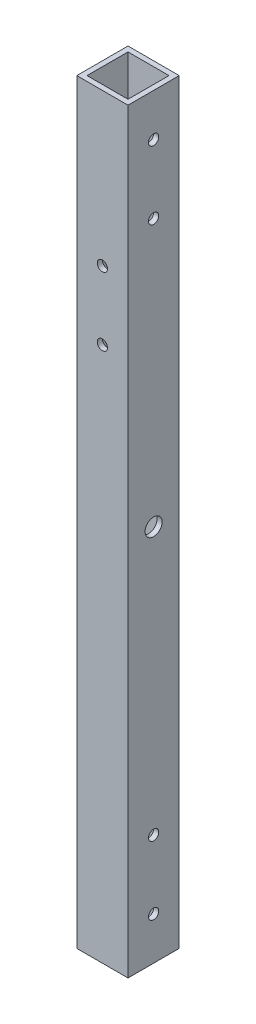
ISO-10303-21;
HEADER;
FILE_DESCRIPTION(('STEP AP214'),'2;1');
FILE_NAME('part.step','',(''),(''),'','','');
FILE_SCHEMA(('AUTOMOTIVE_DESIGN { 1 0 10303 214 1 1 1 1 }'));
ENDSEC;
DATA;
#1=APPLICATION_CONTEXT('core data for automotive mechanical design processes');
#2=APPLICATION_PROTOCOL_DEFINITION('international standard','automotive_design',2000,#1);
#3=PRODUCT_CONTEXT('',#1,'mechanical');
#4=PRODUCT('Part','Part','',(#3));
#5=PRODUCT_RELATED_PRODUCT_CATEGORY('part','',(#4));
#6=PRODUCT_DEFINITION_FORMATION('','',#4);
#7=PRODUCT_DEFINITION_CONTEXT('part definition',#1,'design');
#8=PRODUCT_DEFINITION('design','',#6,#7);
#9=PRODUCT_DEFINITION_SHAPE('','',#8);
#10=(LENGTH_UNIT() NAMED_UNIT(*) SI_UNIT(.MILLI.,.METRE.));
#11=(NAMED_UNIT(*) PLANE_ANGLE_UNIT() SI_UNIT($,.RADIAN.));
#12=(NAMED_UNIT(*) SI_UNIT($,.STERADIAN.) SOLID_ANGLE_UNIT());
#13=UNCERTAINTY_MEASURE_WITH_UNIT(LENGTH_MEASURE(1.E-05),#10,'distance_accuracy_value','');
#14=(GEOMETRIC_REPRESENTATION_CONTEXT(3) GLOBAL_UNCERTAINTY_ASSIGNED_CONTEXT((#13)) GLOBAL_UNIT_ASSIGNED_CONTEXT((#10,
#11,#12)) REPRESENTATION_CONTEXT('',''));
#15=CARTESIAN_POINT('',(0.,0.,0.));
#16=DIRECTION('',(0.,0.,1.));
#17=DIRECTION('',(1.,0.,0.));
#18=AXIS2_PLACEMENT_3D('',#15,#16,#17);
#19=CARTESIAN_POINT('',(0.,221.3,0.));
#20=DIRECTION('',(0.,1.,0.));
#21=DIRECTION('',(0.,0.,1.));
#22=AXIS2_PLACEMENT_3D('',#19,#20,#21);
#23=PLANE('',#22);
#24=DIRECTION('',(0.,0.,1.));
#25=VECTOR('',#24,1.);
#26=CARTESIAN_POINT('',(0.,221.3,0.));
#27=LINE('',#26,#25);
#28=CARTESIAN_POINT('',(0.,221.3,-15.));
#29=VERTEX_POINT('',#28);
#30=CARTESIAN_POINT('',(0.,221.3,0.));
#31=VERTEX_POINT('',#30);
#32=EDGE_CURVE('E170',#29,#31,#27,.T.);
#33=ORIENTED_EDGE('',*,*,#32,.T.);
#34=DIRECTION('',(1.,0.,0.));
#35=VECTOR('',#34,1.);
#36=CARTESIAN_POINT('',(0.,221.3,0.));
#37=LINE('',#36,#35);
#38=CARTESIAN_POINT('',(15.,221.3,0.));
#39=VERTEX_POINT('',#38);
#40=EDGE_CURVE('E173',#31,#39,#37,.T.);
#41=ORIENTED_EDGE('',*,*,#40,.T.);
#42=DIRECTION('',(0.,0.,-1.));
#43=VECTOR('',#42,1.);
#44=CARTESIAN_POINT('',(15.,221.3,0.));
#45=LINE('',#44,#43);
#46=CARTESIAN_POINT('',(15.,221.3,-15.));
#47=VERTEX_POINT('',#46);
#48=EDGE_CURVE('E176',#39,#47,#45,.T.);
#49=ORIENTED_EDGE('',*,*,#48,.T.);
#50=DIRECTION('',(-1.,0.,0.));
#51=VECTOR('',#50,1.);
#52=CARTESIAN_POINT('',(0.,221.3,-15.));
#53=LINE('',#52,#51);
#54=EDGE_CURVE('E178',#47,#29,#53,.T.);
#55=ORIENTED_EDGE('',*,*,#54,.T.);
#56=EDGE_LOOP('',(#33,#41,#49,#55));
#57=FACE_BOUND('',#56,.T.);
#58=DIRECTION('',(1.,0.,0.));
#59=VECTOR('',#58,1.);
#60=CARTESIAN_POINT('',(0.,221.3,-1.5));
#61=LINE('',#60,#59);
#62=CARTESIAN_POINT('',(1.5,221.3,-1.5));
#63=VERTEX_POINT('',#62);
#64=CARTESIAN_POINT('',(13.5,221.3,-1.5));
#65=VERTEX_POINT('',#64);
#66=EDGE_CURVE('E140',#63,#65,#61,.T.);
#67=ORIENTED_EDGE('',*,*,#66,.F.);
#68=DIRECTION('',(0.,0.,1.));
#69=VECTOR('',#68,1.);
#70=CARTESIAN_POINT('',(1.5,221.3,0.));
#71=LINE('',#70,#69);
#72=CARTESIAN_POINT('',(1.5,221.3,-13.5));
#73=VERTEX_POINT('',#72);
#74=EDGE_CURVE('E132',#73,#63,#71,.T.);
#75=ORIENTED_EDGE('',*,*,#74,.F.);
#76=DIRECTION('',(-1.,0.,0.));
#77=VECTOR('',#76,1.);
#78=CARTESIAN_POINT('',(0.,221.3,-13.5));
#79=LINE('',#78,#77);
#80=CARTESIAN_POINT('',(13.5,221.3,-13.5));
#81=VERTEX_POINT('',#80);
#82=EDGE_CURVE('E154',#81,#73,#79,.T.);
#83=ORIENTED_EDGE('',*,*,#82,.F.);
#84=DIRECTION('',(0.,0.,-1.));
#85=VECTOR('',#84,1.);
#86=CARTESIAN_POINT('',(13.5,221.3,0.));
#87=LINE('',#86,#85);
#88=EDGE_CURVE('E152',#65,#81,#87,.T.);
#89=ORIENTED_EDGE('',*,*,#88,.F.);
#90=EDGE_LOOP('',(#67,#75,#83,#89));
#91=FACE_BOUND('',#90,.T.);
#92=ADVANCED_FACE('F65',(#57,#91),#23,.T.);
#93=CARTESIAN_POINT('',(0.,0.,0.));
#94=DIRECTION('',(0.,1.,0.));
#95=DIRECTION('',(0.,0.,1.));
#96=AXIS2_PLACEMENT_3D('',#93,#94,#95);
#97=PLANE('',#96);
#98=DIRECTION('',(0.,0.,1.));
#99=VECTOR('',#98,1.);
#100=CARTESIAN_POINT('',(0.,0.,0.));
#101=LINE('',#100,#99);
#102=CARTESIAN_POINT('',(0.,0.,-15.));
#103=VERTEX_POINT('',#102);
#104=CARTESIAN_POINT('',(0.,0.,0.));
#105=VERTEX_POINT('',#104);
#106=EDGE_CURVE('E148',#103,#105,#101,.T.);
#107=ORIENTED_EDGE('',*,*,#106,.F.);
#108=DIRECTION('',(-1.,0.,0.));
#109=VECTOR('',#108,1.);
#110=CARTESIAN_POINT('',(0.,0.,-15.));
#111=LINE('',#110,#109);
#112=CARTESIAN_POINT('',(15.,0.,-15.));
#113=VERTEX_POINT('',#112);
#114=EDGE_CURVE('E174',#113,#103,#111,.T.);
#115=ORIENTED_EDGE('',*,*,#114,.F.);
#116=DIRECTION('',(0.,0.,-1.));
#117=VECTOR('',#116,1.);
#118=CARTESIAN_POINT('',(15.,0.,0.));
#119=LINE('',#118,#117);
#120=CARTESIAN_POINT('',(15.,0.,0.));
#121=VERTEX_POINT('',#120);
#122=EDGE_CURVE('E185',#121,#113,#119,.T.);
#123=ORIENTED_EDGE('',*,*,#122,.F.);
#124=DIRECTION('',(1.,0.,0.));
#125=VECTOR('',#124,1.);
#126=CARTESIAN_POINT('',(0.,0.,0.));
#127=LINE('',#126,#125);
#128=EDGE_CURVE('E183',#105,#121,#127,.T.);
#129=ORIENTED_EDGE('',*,*,#128,.F.);
#130=EDGE_LOOP('',(#107,#115,#123,#129));
#131=FACE_BOUND('',#130,.T.);
#132=DIRECTION('',(0.,0.,1.));
#133=VECTOR('',#132,1.);
#134=CARTESIAN_POINT('',(1.5,0.,0.));
#135=LINE('',#134,#133);
#136=CARTESIAN_POINT('',(1.5,0.,-13.5));
#137=VERTEX_POINT('',#136);
#138=CARTESIAN_POINT('',(1.5,0.,-1.5));
#139=VERTEX_POINT('',#138);
#140=EDGE_CURVE('E90',#137,#139,#135,.T.);
#141=ORIENTED_EDGE('',*,*,#140,.T.);
#142=DIRECTION('',(1.,0.,0.));
#143=VECTOR('',#142,1.);
#144=CARTESIAN_POINT('',(0.,0.,-1.5));
#145=LINE('',#144,#143);
#146=CARTESIAN_POINT('',(13.5,0.,-1.5));
#147=VERTEX_POINT('',#146);
#148=EDGE_CURVE('E147',#139,#147,#145,.T.);
#149=ORIENTED_EDGE('',*,*,#148,.T.);
#150=DIRECTION('',(0.,0.,-1.));
#151=VECTOR('',#150,1.);
#152=CARTESIAN_POINT('',(13.5,0.,0.));
#153=LINE('',#152,#151);
#154=CARTESIAN_POINT('',(13.5,0.,-13.5));
#155=VERTEX_POINT('',#154);
#156=EDGE_CURVE('E162',#147,#155,#153,.T.);
#157=ORIENTED_EDGE('',*,*,#156,.T.);
#158=DIRECTION('',(-1.,0.,0.));
#159=VECTOR('',#158,1.);
#160=CARTESIAN_POINT('',(0.,0.,-13.5));
#161=LINE('',#160,#159);
#162=EDGE_CURVE('E141',#155,#137,#161,.T.);
#163=ORIENTED_EDGE('',*,*,#162,.T.);
#164=EDGE_LOOP('',(#141,#149,#157,#163));
#165=FACE_BOUND('',#164,.T.);
#166=ADVANCED_FACE('F304',(#131,#165),#97,.F.);
#167=CARTESIAN_POINT('',(0.,221.3,0.));
#168=DIRECTION('',(1.,0.,0.));
#169=DIRECTION('',(0.,0.,-1.));
#170=AXIS2_PLACEMENT_3D('',#167,#168,#169);
#171=PLANE('',#170);
#172=CARTESIAN_POINT('',(0.,110.65,-7.5));
#173=DIRECTION('',(1.,0.,0.));
#174=DIRECTION('',(0.,0.,-1.));
#175=AXIS2_PLACEMENT_3D('',#172,#173,#174);
#176=CIRCLE('',#175,2.5);
#177=CARTESIAN_POINT('',(0.,110.65,-10.));
#178=VERTEX_POINT('',#177);
#179=EDGE_CURVE('E214',#178,#178,#176,.T.);
#180=ORIENTED_EDGE('',*,*,#179,.T.);
#181=EDGE_LOOP('',(#180));
#182=FACE_BOUND('',#181,.T.);
#183=CARTESIAN_POINT('',(0.,208.8,-7.49999999999862));
#184=DIRECTION('',(-1.,0.,0.));
#185=DIRECTION('',(0.,0.,1.));
#186=AXIS2_PLACEMENT_3D('',#183,#184,#185);
#187=CIRCLE('',#186,1.5);
#188=CARTESIAN_POINT('',(0.,208.8,-5.99999999999862));
#189=VERTEX_POINT('',#188);
#190=EDGE_CURVE('E250',#189,#189,#187,.T.);
#191=ORIENTED_EDGE('',*,*,#190,.F.);
#192=EDGE_LOOP('',(#191));
#193=FACE_BOUND('',#192,.T.);
#194=CARTESIAN_POINT('',(0.,188.8,-7.49999999999862));
#195=DIRECTION('',(-1.,0.,0.));
#196=DIRECTION('',(0.,0.,1.));
#197=AXIS2_PLACEMENT_3D('',#194,#195,#196);
#198=CIRCLE('',#197,1.5);
#199=CARTESIAN_POINT('',(0.,188.8,-5.99999999999862));
#200=VERTEX_POINT('',#199);
#201=EDGE_CURVE('E253',#200,#200,#198,.T.);
#202=ORIENTED_EDGE('',*,*,#201,.F.);
#203=EDGE_LOOP('',(#202));
#204=FACE_BOUND('',#203,.T.);
#205=CARTESIAN_POINT('',(0.,32.5039999999969,-7.49999999999862));
#206=DIRECTION('',(-1.,0.,0.));
#207=DIRECTION('',(0.,0.,1.));
#208=AXIS2_PLACEMENT_3D('',#205,#206,#207);
#209=CIRCLE('',#208,1.5);
#210=CARTESIAN_POINT('',(0.,32.5039999999969,-5.99999999999862));
#211=VERTEX_POINT('',#210);
#212=EDGE_CURVE('E259',#211,#211,#209,.T.);
#213=ORIENTED_EDGE('',*,*,#212,.F.);
#214=EDGE_LOOP('',(#213));
#215=FACE_BOUND('',#214,.T.);
#216=CARTESIAN_POINT('',(0.,12.5039999999969,-7.49999999999862));
#217=DIRECTION('',(-1.,0.,0.));
#218=DIRECTION('',(0.,0.,1.));
#219=AXIS2_PLACEMENT_3D('',#216,#217,#218);
#220=CIRCLE('',#219,1.5);
#221=CARTESIAN_POINT('',(0.,12.5039999999969,-5.99999999999862));
#222=VERTEX_POINT('',#221);
#223=EDGE_CURVE('E265',#222,#222,#220,.T.);
#224=ORIENTED_EDGE('',*,*,#223,.F.);
#225=EDGE_LOOP('',(#224));
#226=FACE_BOUND('',#225,.T.);
#227=ORIENTED_EDGE('',*,*,#106,.T.);
#228=DIRECTION('',(0.,-1.,0.));
#229=VECTOR('',#228,1.);
#230=CARTESIAN_POINT('',(0.,221.3,0.));
#231=LINE('',#230,#229);
#232=EDGE_CURVE('E12',#31,#105,#231,.T.);
#233=ORIENTED_EDGE('',*,*,#232,.F.);
#234=ORIENTED_EDGE('',*,*,#32,.F.);
#235=DIRECTION('',(0.,-1.,0.));
#236=VECTOR('',#235,1.);
#237=CARTESIAN_POINT('',(0.,221.3,-15.));
#238=LINE('',#237,#236);
#239=EDGE_CURVE('E180',#29,#103,#238,.T.);
#240=ORIENTED_EDGE('',*,*,#239,.T.);
#241=EDGE_LOOP('',(#227,#233,#234,#240));
#242=FACE_BOUND('',#241,.T.);
#243=ADVANCED_FACE('F67',(#182,#193,#204,#215,#226,#242),#171,.F.);
#244=CARTESIAN_POINT('',(0.,221.3,0.));
#245=DIRECTION('',(0.,0.,-1.));
#246=DIRECTION('',(-1.,0.,0.));
#247=AXIS2_PLACEMENT_3D('',#244,#245,#246);
#248=PLANE('',#247);
#249=CARTESIAN_POINT('',(7.50000000000002,156.8,0.));
#250=DIRECTION('',(0.,0.,1.));
#251=DIRECTION('',(1.,0.,0.));
#252=AXIS2_PLACEMENT_3D('',#249,#250,#251);
#253=CIRCLE('',#252,1.5);
#254=CARTESIAN_POINT('',(9.00000000000001,156.8,0.));
#255=VERTEX_POINT('',#254);
#256=EDGE_CURVE('E224',#255,#255,#253,.T.);
#257=ORIENTED_EDGE('',*,*,#256,.F.);
#258=EDGE_LOOP('',(#257));
#259=FACE_BOUND('',#258,.T.);
#260=CARTESIAN_POINT('',(7.50000000000002,176.8,0.));
#261=DIRECTION('',(0.,0.,1.));
#262=DIRECTION('',(1.,0.,0.));
#263=AXIS2_PLACEMENT_3D('',#260,#261,#262);
#264=CIRCLE('',#263,1.5);
#265=CARTESIAN_POINT('',(9.00000000000002,176.8,0.));
#266=VERTEX_POINT('',#265);
#267=EDGE_CURVE('E229',#266,#266,#264,.T.);
#268=ORIENTED_EDGE('',*,*,#267,.F.);
#269=EDGE_LOOP('',(#268));
#270=FACE_BOUND('',#269,.T.);
#271=ORIENTED_EDGE('',*,*,#128,.T.);
#272=DIRECTION('',(0.,-1.,0.));
#273=VECTOR('',#272,1.);
#274=CARTESIAN_POINT('',(15.,221.3,0.));
#275=LINE('',#274,#273);
#276=EDGE_CURVE('E74',#39,#121,#275,.T.);
#277=ORIENTED_EDGE('',*,*,#276,.F.);
#278=ORIENTED_EDGE('',*,*,#40,.F.);
#279=ORIENTED_EDGE('',*,*,#232,.T.);
#280=EDGE_LOOP('',(#271,#277,#278,#279));
#281=FACE_BOUND('',#280,.T.);
#282=ADVANCED_FACE('F303',(#259,#270,#281),#248,.F.);
#283=CARTESIAN_POINT('',(15.,221.3,0.));
#284=DIRECTION('',(-1.,0.,0.));
#285=DIRECTION('',(0.,0.,1.));
#286=AXIS2_PLACEMENT_3D('',#283,#284,#285);
#287=PLANE('',#286);
#288=CARTESIAN_POINT('',(15.,110.65,-7.5));
#289=DIRECTION('',(1.,0.,0.));
#290=DIRECTION('',(0.,0.,-1.));
#291=AXIS2_PLACEMENT_3D('',#288,#289,#290);
#292=CIRCLE('',#291,2.5);
#293=CARTESIAN_POINT('',(15.,110.65,-10.));
#294=VERTEX_POINT('',#293);
#295=EDGE_CURVE('E240',#294,#294,#292,.T.);
#296=ORIENTED_EDGE('',*,*,#295,.F.);
#297=EDGE_LOOP('',(#296));
#298=FACE_BOUND('',#297,.T.);
#299=CARTESIAN_POINT('',(15.,208.8,-7.49999999999862));
#300=DIRECTION('',(-1.,0.,0.));
#301=DIRECTION('',(0.,0.,1.));
#302=AXIS2_PLACEMENT_3D('',#299,#300,#301);
#303=CIRCLE('',#302,1.5);
#304=CARTESIAN_POINT('',(15.,208.8,-5.99999999999862));
#305=VERTEX_POINT('',#304);
#306=EDGE_CURVE('E199',#305,#305,#303,.T.);
#307=ORIENTED_EDGE('',*,*,#306,.T.);
#308=EDGE_LOOP('',(#307));
#309=FACE_BOUND('',#308,.T.);
#310=CARTESIAN_POINT('',(15.,188.8,-7.49999999999862));
#311=DIRECTION('',(-1.,0.,0.));
#312=DIRECTION('',(0.,0.,1.));
#313=AXIS2_PLACEMENT_3D('',#310,#311,#312);
#314=CIRCLE('',#313,1.5);
#315=CARTESIAN_POINT('',(15.,188.8,-5.99999999999862));
#316=VERTEX_POINT('',#315);
#317=EDGE_CURVE('E256',#316,#316,#314,.T.);
#318=ORIENTED_EDGE('',*,*,#317,.T.);
#319=EDGE_LOOP('',(#318));
#320=FACE_BOUND('',#319,.T.);
#321=CARTESIAN_POINT('',(15.,32.5039999999969,-7.49999999999862));
#322=DIRECTION('',(-1.,0.,0.));
#323=DIRECTION('',(0.,0.,1.));
#324=AXIS2_PLACEMENT_3D('',#321,#322,#323);
#325=CIRCLE('',#324,1.5);
#326=CARTESIAN_POINT('',(15.,32.5039999999969,-5.99999999999862));
#327=VERTEX_POINT('',#326);
#328=EDGE_CURVE('E262',#327,#327,#325,.T.);
#329=ORIENTED_EDGE('',*,*,#328,.T.);
#330=EDGE_LOOP('',(#329));
#331=FACE_BOUND('',#330,.T.);
#332=CARTESIAN_POINT('',(15.,12.5039999999969,-7.49999999999862));
#333=DIRECTION('',(-1.,0.,0.));
#334=DIRECTION('',(0.,0.,1.));
#335=AXIS2_PLACEMENT_3D('',#332,#333,#334);
#336=CIRCLE('',#335,1.5);
#337=CARTESIAN_POINT('',(15.,12.5039999999969,-5.99999999999862));
#338=VERTEX_POINT('',#337);
#339=EDGE_CURVE('E247',#338,#338,#336,.T.);
#340=ORIENTED_EDGE('',*,*,#339,.T.);
#341=EDGE_LOOP('',(#340));
#342=FACE_BOUND('',#341,.T.);
#343=ORIENTED_EDGE('',*,*,#122,.T.);
#344=DIRECTION('',(0.,-1.,0.));
#345=VECTOR('',#344,1.);
#346=CARTESIAN_POINT('',(15.,221.3,-15.));
#347=LINE('',#346,#345);
#348=EDGE_CURVE('E190',#47,#113,#347,.T.);
#349=ORIENTED_EDGE('',*,*,#348,.F.);
#350=ORIENTED_EDGE('',*,*,#48,.F.);
#351=ORIENTED_EDGE('',*,*,#276,.T.);
#352=EDGE_LOOP('',(#343,#349,#350,#351));
#353=FACE_BOUND('',#352,.T.);
#354=ADVANCED_FACE('F322',(#298,#309,#320,#331,#342,#353),#287,.F.);
#355=CARTESIAN_POINT('',(0.,221.3,-15.));
#356=DIRECTION('',(0.,0.,1.));
#357=DIRECTION('',(1.,0.,0.));
#358=AXIS2_PLACEMENT_3D('',#355,#356,#357);
#359=PLANE('',#358);
#360=CARTESIAN_POINT('',(7.50000000000002,156.8,-15.));
#361=DIRECTION('',(0.,0.,1.));
#362=DIRECTION('',(1.,0.,0.));
#363=AXIS2_PLACEMENT_3D('',#360,#361,#362);
#364=CIRCLE('',#363,1.5);
#365=CARTESIAN_POINT('',(9.00000000000001,156.8,-15.));
#366=VERTEX_POINT('',#365);
#367=EDGE_CURVE('E218',#366,#366,#364,.T.);
#368=ORIENTED_EDGE('',*,*,#367,.T.);
#369=EDGE_LOOP('',(#368));
#370=FACE_BOUND('',#369,.T.);
#371=CARTESIAN_POINT('',(7.50000000000002,176.8,-15.));
#372=DIRECTION('',(0.,0.,1.));
#373=DIRECTION('',(1.,0.,0.));
#374=AXIS2_PLACEMENT_3D('',#371,#372,#373);
#375=CIRCLE('',#374,1.5);
#376=CARTESIAN_POINT('',(9.00000000000002,176.8,-15.));
#377=VERTEX_POINT('',#376);
#378=EDGE_CURVE('E234',#377,#377,#375,.T.);
#379=ORIENTED_EDGE('',*,*,#378,.T.);
#380=EDGE_LOOP('',(#379));
#381=FACE_BOUND('',#380,.T.);
#382=ORIENTED_EDGE('',*,*,#114,.T.);
#383=ORIENTED_EDGE('',*,*,#239,.F.);
#384=ORIENTED_EDGE('',*,*,#54,.F.);
#385=ORIENTED_EDGE('',*,*,#348,.T.);
#386=EDGE_LOOP('',(#382,#383,#384,#385));
#387=FACE_BOUND('',#386,.T.);
#388=ADVANCED_FACE('F283',(#370,#381,#387),#359,.F.);
#389=CARTESIAN_POINT('',(1.5,221.3,0.));
#390=DIRECTION('',(1.,0.,0.));
#391=DIRECTION('',(0.,0.,-1.));
#392=AXIS2_PLACEMENT_3D('',#389,#390,#391);
#393=PLANE('',#392);
#394=CARTESIAN_POINT('',(1.5,110.65,-7.5));
#395=DIRECTION('',(1.,0.,0.));
#396=DIRECTION('',(0.,0.,-1.));
#397=AXIS2_PLACEMENT_3D('',#394,#395,#396);
#398=CIRCLE('',#397,2.5);
#399=CARTESIAN_POINT('',(1.5,110.65,-10.));
#400=VERTEX_POINT('',#399);
#401=EDGE_CURVE('E213',#400,#400,#398,.T.);
#402=ORIENTED_EDGE('',*,*,#401,.F.);
#403=EDGE_LOOP('',(#402));
#404=FACE_BOUND('',#403,.T.);
#405=CARTESIAN_POINT('',(1.5,208.8,-7.49999999999862));
#406=DIRECTION('',(1.,0.,0.));
#407=DIRECTION('',(0.,0.,-1.));
#408=AXIS2_PLACEMENT_3D('',#405,#406,#407);
#409=CIRCLE('',#408,1.5);
#410=CARTESIAN_POINT('',(1.5,208.8,-8.99999999999862));
#411=VERTEX_POINT('',#410);
#412=EDGE_CURVE('E160',#411,#411,#409,.T.);
#413=ORIENTED_EDGE('',*,*,#412,.F.);
#414=EDGE_LOOP('',(#413));
#415=FACE_BOUND('',#414,.T.);
#416=CARTESIAN_POINT('',(1.5,188.8,-7.49999999999862));
#417=DIRECTION('',(1.,0.,0.));
#418=DIRECTION('',(0.,0.,-1.));
#419=AXIS2_PLACEMENT_3D('',#416,#417,#418);
#420=CIRCLE('',#419,1.5);
#421=CARTESIAN_POINT('',(1.5,188.8,-8.99999999999862));
#422=VERTEX_POINT('',#421);
#423=EDGE_CURVE('E207',#422,#422,#420,.T.);
#424=ORIENTED_EDGE('',*,*,#423,.F.);
#425=EDGE_LOOP('',(#424));
#426=FACE_BOUND('',#425,.T.);
#427=CARTESIAN_POINT('',(1.5,32.5039999999969,-7.49999999999862));
#428=DIRECTION('',(1.,0.,0.));
#429=DIRECTION('',(0.,0.,-1.));
#430=AXIS2_PLACEMENT_3D('',#427,#428,#429);
#431=CIRCLE('',#430,1.5);
#432=CARTESIAN_POINT('',(1.5,32.5039999999969,-8.99999999999862));
#433=VERTEX_POINT('',#432);
#434=EDGE_CURVE('E203',#433,#433,#431,.T.);
#435=ORIENTED_EDGE('',*,*,#434,.F.);
#436=EDGE_LOOP('',(#435));
#437=FACE_BOUND('',#436,.T.);
#438=CARTESIAN_POINT('',(1.5,12.5039999999969,-7.49999999999862));
#439=DIRECTION('',(1.,0.,0.));
#440=DIRECTION('',(0.,0.,-1.));
#441=AXIS2_PLACEMENT_3D('',#438,#439,#440);
#442=CIRCLE('',#441,1.5);
#443=CARTESIAN_POINT('',(1.5,12.5039999999969,-8.99999999999862));
#444=VERTEX_POINT('',#443);
#445=EDGE_CURVE('E198',#444,#444,#442,.T.);
#446=ORIENTED_EDGE('',*,*,#445,.F.);
#447=EDGE_LOOP('',(#446));
#448=FACE_BOUND('',#447,.T.);
#449=ORIENTED_EDGE('',*,*,#140,.F.);
#450=DIRECTION('',(0.,-1.,0.));
#451=VECTOR('',#450,1.);
#452=CARTESIAN_POINT('',(1.5,221.3,-13.5));
#453=LINE('',#452,#451);
#454=EDGE_CURVE('E136',#73,#137,#453,.T.);
#455=ORIENTED_EDGE('',*,*,#454,.F.);
#456=ORIENTED_EDGE('',*,*,#74,.T.);
#457=DIRECTION('',(0.,-1.,0.));
#458=VECTOR('',#457,1.);
#459=CARTESIAN_POINT('',(1.5,221.3,-1.5));
#460=LINE('',#459,#458);
#461=EDGE_CURVE('E135',#63,#139,#460,.T.);
#462=ORIENTED_EDGE('',*,*,#461,.T.);
#463=EDGE_LOOP('',(#449,#455,#456,#462));
#464=FACE_BOUND('',#463,.T.);
#465=ADVANCED_FACE('F134',(#404,#415,#426,#437,#448,#464),#393,.T.);
#466=CARTESIAN_POINT('',(0.,221.3,-1.5));
#467=DIRECTION('',(0.,0.,-1.));
#468=DIRECTION('',(-1.,0.,0.));
#469=AXIS2_PLACEMENT_3D('',#466,#467,#468);
#470=PLANE('',#469);
#471=CARTESIAN_POINT('',(7.50000000000002,156.8,-1.5));
#472=DIRECTION('',(0.,0.,-1.));
#473=DIRECTION('',(-1.,0.,0.));
#474=AXIS2_PLACEMENT_3D('',#471,#472,#473);
#475=CIRCLE('',#474,1.5);
#476=CARTESIAN_POINT('',(6.00000000000002,156.8,-1.5));
#477=VERTEX_POINT('',#476);
#478=EDGE_CURVE('E237',#477,#477,#475,.T.);
#479=ORIENTED_EDGE('',*,*,#478,.F.);
#480=EDGE_LOOP('',(#479));
#481=FACE_BOUND('',#480,.T.);
#482=CARTESIAN_POINT('',(7.50000000000002,176.8,-1.5));
#483=DIRECTION('',(0.,0.,-1.));
#484=DIRECTION('',(-1.,0.,0.));
#485=AXIS2_PLACEMENT_3D('',#482,#483,#484);
#486=CIRCLE('',#485,1.5);
#487=CARTESIAN_POINT('',(6.00000000000001,176.8,-1.5));
#488=VERTEX_POINT('',#487);
#489=EDGE_CURVE('E217',#488,#488,#486,.T.);
#490=ORIENTED_EDGE('',*,*,#489,.F.);
#491=EDGE_LOOP('',(#490));
#492=FACE_BOUND('',#491,.T.);
#493=ORIENTED_EDGE('',*,*,#148,.F.);
#494=ORIENTED_EDGE('',*,*,#461,.F.);
#495=ORIENTED_EDGE('',*,*,#66,.T.);
#496=DIRECTION('',(0.,-1.,0.));
#497=VECTOR('',#496,1.);
#498=CARTESIAN_POINT('',(13.5,221.3,-1.5));
#499=LINE('',#498,#497);
#500=EDGE_CURVE('E149',#65,#147,#499,.T.);
#501=ORIENTED_EDGE('',*,*,#500,.T.);
#502=EDGE_LOOP('',(#493,#494,#495,#501));
#503=FACE_BOUND('',#502,.T.);
#504=ADVANCED_FACE('F144',(#481,#492,#503),#470,.T.);
#505=CARTESIAN_POINT('',(13.5,221.3,0.));
#506=DIRECTION('',(-1.,0.,0.));
#507=DIRECTION('',(0.,0.,1.));
#508=AXIS2_PLACEMENT_3D('',#505,#506,#507);
#509=PLANE('',#508);
#510=CARTESIAN_POINT('',(13.5,110.65,-7.5));
#511=DIRECTION('',(-1.,0.,0.));
#512=DIRECTION('',(0.,0.,1.));
#513=AXIS2_PLACEMENT_3D('',#510,#511,#512);
#514=CIRCLE('',#513,2.5);
#515=CARTESIAN_POINT('',(13.5,110.65,-5.));
#516=VERTEX_POINT('',#515);
#517=EDGE_CURVE('E211',#516,#516,#514,.T.);
#518=ORIENTED_EDGE('',*,*,#517,.F.);
#519=EDGE_LOOP('',(#518));
#520=FACE_BOUND('',#519,.T.);
#521=CARTESIAN_POINT('',(13.5,208.8,-7.49999999999862));
#522=DIRECTION('',(-1.,0.,0.));
#523=DIRECTION('',(0.,0.,1.));
#524=AXIS2_PLACEMENT_3D('',#521,#522,#523);
#525=CIRCLE('',#524,1.5);
#526=CARTESIAN_POINT('',(13.5,208.8,-5.99999999999862));
#527=VERTEX_POINT('',#526);
#528=EDGE_CURVE('E208',#527,#527,#525,.T.);
#529=ORIENTED_EDGE('',*,*,#528,.F.);
#530=EDGE_LOOP('',(#529));
#531=FACE_BOUND('',#530,.T.);
#532=CARTESIAN_POINT('',(13.5,188.8,-7.49999999999862));
#533=DIRECTION('',(-1.,0.,0.));
#534=DIRECTION('',(0.,0.,1.));
#535=AXIS2_PLACEMENT_3D('',#532,#533,#534);
#536=CIRCLE('',#535,1.5);
#537=CARTESIAN_POINT('',(13.5,188.8,-5.99999999999862));
#538=VERTEX_POINT('',#537);
#539=EDGE_CURVE('E204',#538,#538,#536,.T.);
#540=ORIENTED_EDGE('',*,*,#539,.F.);
#541=EDGE_LOOP('',(#540));
#542=FACE_BOUND('',#541,.T.);
#543=CARTESIAN_POINT('',(13.5,32.5039999999969,-7.49999999999862));
#544=DIRECTION('',(-1.,0.,0.));
#545=DIRECTION('',(0.,0.,1.));
#546=AXIS2_PLACEMENT_3D('',#543,#544,#545);
#547=CIRCLE('',#546,1.5);
#548=CARTESIAN_POINT('',(13.5,32.5039999999969,-5.99999999999862));
#549=VERTEX_POINT('',#548);
#550=EDGE_CURVE('E200',#549,#549,#547,.T.);
#551=ORIENTED_EDGE('',*,*,#550,.F.);
#552=EDGE_LOOP('',(#551));
#553=FACE_BOUND('',#552,.T.);
#554=CARTESIAN_POINT('',(13.5,12.5039999999969,-7.49999999999862));
#555=DIRECTION('',(-1.,0.,0.));
#556=DIRECTION('',(0.,0.,1.));
#557=AXIS2_PLACEMENT_3D('',#554,#555,#556);
#558=CIRCLE('',#557,1.5);
#559=CARTESIAN_POINT('',(13.5,12.5039999999969,-5.99999999999862));
#560=VERTEX_POINT('',#559);
#561=EDGE_CURVE('E195',#560,#560,#558,.T.);
#562=ORIENTED_EDGE('',*,*,#561,.F.);
#563=EDGE_LOOP('',(#562));
#564=FACE_BOUND('',#563,.T.);
#565=ORIENTED_EDGE('',*,*,#156,.F.);
#566=ORIENTED_EDGE('',*,*,#500,.F.);
#567=ORIENTED_EDGE('',*,*,#88,.T.);
#568=DIRECTION('',(0.,-1.,0.));
#569=VECTOR('',#568,1.);
#570=CARTESIAN_POINT('',(13.5,221.3,-13.5));
#571=LINE('',#570,#569);
#572=EDGE_CURVE('E82',#81,#155,#571,.T.);
#573=ORIENTED_EDGE('',*,*,#572,.T.);
#574=EDGE_LOOP('',(#565,#566,#567,#573));
#575=FACE_BOUND('',#574,.T.);
#576=ADVANCED_FACE('F343',(#520,#531,#542,#553,#564,#575),#509,.T.);
#577=CARTESIAN_POINT('',(0.,221.3,-13.5));
#578=DIRECTION('',(0.,0.,1.));
#579=DIRECTION('',(1.,0.,0.));
#580=AXIS2_PLACEMENT_3D('',#577,#578,#579);
#581=PLANE('',#580);
#582=CARTESIAN_POINT('',(7.50000000000002,156.8,-13.5));
#583=DIRECTION('',(0.,0.,1.));
#584=DIRECTION('',(1.,0.,0.));
#585=AXIS2_PLACEMENT_3D('',#582,#583,#584);
#586=CIRCLE('',#585,1.5);
#587=CARTESIAN_POINT('',(9.00000000000001,156.8,-13.5));
#588=VERTEX_POINT('',#587);
#589=EDGE_CURVE('E69',#588,#588,#586,.T.);
#590=ORIENTED_EDGE('',*,*,#589,.F.);
#591=EDGE_LOOP('',(#590));
#592=FACE_BOUND('',#591,.T.);
#593=CARTESIAN_POINT('',(7.50000000000002,176.8,-13.5));
#594=DIRECTION('',(0.,0.,1.));
#595=DIRECTION('',(1.,0.,0.));
#596=AXIS2_PLACEMENT_3D('',#593,#594,#595);
#597=CIRCLE('',#596,1.5);
#598=CARTESIAN_POINT('',(9.00000000000002,176.8,-13.5));
#599=VERTEX_POINT('',#598);
#600=EDGE_CURVE('E215',#599,#599,#597,.T.);
#601=ORIENTED_EDGE('',*,*,#600,.F.);
#602=EDGE_LOOP('',(#601));
#603=FACE_BOUND('',#602,.T.);
#604=ORIENTED_EDGE('',*,*,#162,.F.);
#605=ORIENTED_EDGE('',*,*,#572,.F.);
#606=ORIENTED_EDGE('',*,*,#82,.T.);
#607=ORIENTED_EDGE('',*,*,#454,.T.);
#608=EDGE_LOOP('',(#604,#605,#606,#607));
#609=FACE_BOUND('',#608,.T.);
#610=ADVANCED_FACE('F347',(#592,#603,#609),#581,.T.);
#611=CARTESIAN_POINT('',(15.,12.5039999999969,-7.49999999999862));
#612=DIRECTION('',(-1.,0.,0.));
#613=DIRECTION('',(0.,0.,1.));
#614=AXIS2_PLACEMENT_3D('',#611,#612,#613);
#615=CYLINDRICAL_SURFACE('',#614,1.5);
#616=ORIENTED_EDGE('',*,*,#561,.T.);
#617=EDGE_LOOP('',(#616));
#618=FACE_BOUND('',#617,.T.);
#619=ORIENTED_EDGE('',*,*,#339,.F.);
#620=EDGE_LOOP('',(#619));
#621=FACE_BOUND('',#620,.T.);
#622=ADVANCED_FACE('F298',(#618,#621),#615,.F.);
#623=CARTESIAN_POINT('',(15.,32.5039999999969,-7.49999999999862));
#624=DIRECTION('',(-1.,0.,0.));
#625=DIRECTION('',(0.,0.,1.));
#626=AXIS2_PLACEMENT_3D('',#623,#624,#625);
#627=CYLINDRICAL_SURFACE('',#626,1.5);
#628=ORIENTED_EDGE('',*,*,#550,.T.);
#629=EDGE_LOOP('',(#628));
#630=FACE_BOUND('',#629,.T.);
#631=ORIENTED_EDGE('',*,*,#328,.F.);
#632=EDGE_LOOP('',(#631));
#633=FACE_BOUND('',#632,.T.);
#634=ADVANCED_FACE('F353',(#630,#633),#627,.F.);
#635=CARTESIAN_POINT('',(15.,188.8,-7.49999999999862));
#636=DIRECTION('',(-1.,0.,0.));
#637=DIRECTION('',(0.,0.,1.));
#638=AXIS2_PLACEMENT_3D('',#635,#636,#637);
#639=CYLINDRICAL_SURFACE('',#638,1.5);
#640=ORIENTED_EDGE('',*,*,#539,.T.);
#641=EDGE_LOOP('',(#640));
#642=FACE_BOUND('',#641,.T.);
#643=ORIENTED_EDGE('',*,*,#317,.F.);
#644=EDGE_LOOP('',(#643));
#645=FACE_BOUND('',#644,.T.);
#646=ADVANCED_FACE('F357',(#642,#645),#639,.F.);
#647=CARTESIAN_POINT('',(15.,208.8,-7.49999999999862));
#648=DIRECTION('',(-1.,0.,0.));
#649=DIRECTION('',(0.,0.,1.));
#650=AXIS2_PLACEMENT_3D('',#647,#648,#649);
#651=CYLINDRICAL_SURFACE('',#650,1.5);
#652=ORIENTED_EDGE('',*,*,#528,.T.);
#653=EDGE_LOOP('',(#652));
#654=FACE_BOUND('',#653,.T.);
#655=ORIENTED_EDGE('',*,*,#306,.F.);
#656=EDGE_LOOP('',(#655));
#657=FACE_BOUND('',#656,.T.);
#658=ADVANCED_FACE('F296',(#654,#657),#651,.F.);
#659=ORIENTED_EDGE('',*,*,#445,.T.);
#660=EDGE_LOOP('',(#659));
#661=FACE_BOUND('',#660,.T.);
#662=ORIENTED_EDGE('',*,*,#223,.T.);
#663=EDGE_LOOP('',(#662));
#664=FACE_BOUND('',#663,.T.);
#665=ADVANCED_FACE('F292',(#661,#664),#615,.F.);
#666=ORIENTED_EDGE('',*,*,#434,.T.);
#667=EDGE_LOOP('',(#666));
#668=FACE_BOUND('',#667,.T.);
#669=ORIENTED_EDGE('',*,*,#212,.T.);
#670=EDGE_LOOP('',(#669));
#671=FACE_BOUND('',#670,.T.);
#672=ADVANCED_FACE('F295',(#668,#671),#627,.F.);
#673=ORIENTED_EDGE('',*,*,#423,.T.);
#674=EDGE_LOOP('',(#673));
#675=FACE_BOUND('',#674,.T.);
#676=ORIENTED_EDGE('',*,*,#201,.T.);
#677=EDGE_LOOP('',(#676));
#678=FACE_BOUND('',#677,.T.);
#679=ADVANCED_FACE('F362',(#675,#678),#639,.F.);
#680=ORIENTED_EDGE('',*,*,#412,.T.);
#681=EDGE_LOOP('',(#680));
#682=FACE_BOUND('',#681,.T.);
#683=ORIENTED_EDGE('',*,*,#190,.T.);
#684=EDGE_LOOP('',(#683));
#685=FACE_BOUND('',#684,.T.);
#686=ADVANCED_FACE('F278',(#682,#685),#651,.F.);
#687=CARTESIAN_POINT('',(0.,110.65,-7.5));
#688=DIRECTION('',(1.,0.,0.));
#689=DIRECTION('',(0.,0.,-1.));
#690=AXIS2_PLACEMENT_3D('',#687,#688,#689);
#691=CYLINDRICAL_SURFACE('',#690,2.5);
#692=ORIENTED_EDGE('',*,*,#517,.T.);
#693=EDGE_LOOP('',(#692));
#694=FACE_BOUND('',#693,.T.);
#695=ORIENTED_EDGE('',*,*,#295,.T.);
#696=EDGE_LOOP('',(#695));
#697=FACE_BOUND('',#696,.T.);
#698=ADVANCED_FACE('F366',(#694,#697),#691,.F.);
#699=ORIENTED_EDGE('',*,*,#401,.T.);
#700=EDGE_LOOP('',(#699));
#701=FACE_BOUND('',#700,.T.);
#702=ORIENTED_EDGE('',*,*,#179,.F.);
#703=EDGE_LOOP('',(#702));
#704=FACE_BOUND('',#703,.T.);
#705=ADVANCED_FACE('F369',(#701,#704),#691,.F.);
#706=CARTESIAN_POINT('',(7.50000000000002,176.8,-15.));
#707=DIRECTION('',(0.,0.,1.));
#708=DIRECTION('',(1.,0.,0.));
#709=AXIS2_PLACEMENT_3D('',#706,#707,#708);
#710=CYLINDRICAL_SURFACE('',#709,1.5);
#711=ORIENTED_EDGE('',*,*,#600,.T.);
#712=EDGE_LOOP('',(#711));
#713=FACE_BOUND('',#712,.T.);
#714=ORIENTED_EDGE('',*,*,#378,.F.);
#715=EDGE_LOOP('',(#714));
#716=FACE_BOUND('',#715,.T.);
#717=ADVANCED_FACE('F371',(#713,#716),#710,.F.);
#718=CARTESIAN_POINT('',(7.50000000000002,156.8,-15.));
#719=DIRECTION('',(0.,0.,1.));
#720=DIRECTION('',(1.,0.,0.));
#721=AXIS2_PLACEMENT_3D('',#718,#719,#720);
#722=CYLINDRICAL_SURFACE('',#721,1.5);
#723=ORIENTED_EDGE('',*,*,#589,.T.);
#724=EDGE_LOOP('',(#723));
#725=FACE_BOUND('',#724,.T.);
#726=ORIENTED_EDGE('',*,*,#367,.F.);
#727=EDGE_LOOP('',(#726));
#728=FACE_BOUND('',#727,.T.);
#729=ADVANCED_FACE('F374',(#725,#728),#722,.F.);
#730=ORIENTED_EDGE('',*,*,#489,.T.);
#731=EDGE_LOOP('',(#730));
#732=FACE_BOUND('',#731,.T.);
#733=ORIENTED_EDGE('',*,*,#267,.T.);
#734=EDGE_LOOP('',(#733));
#735=FACE_BOUND('',#734,.T.);
#736=ADVANCED_FACE('F375',(#732,#735),#710,.F.);
#737=ORIENTED_EDGE('',*,*,#478,.T.);
#738=EDGE_LOOP('',(#737));
#739=FACE_BOUND('',#738,.T.);
#740=ORIENTED_EDGE('',*,*,#256,.T.);
#741=EDGE_LOOP('',(#740));
#742=FACE_BOUND('',#741,.T.);
#743=ADVANCED_FACE('F378',(#739,#742),#722,.F.);
#744=CLOSED_SHELL('',(#92,#166,#243,#282,#354,#388,#465,#504,#576,#610,#622,#634,#646,#658,#665,
#672,#679,#686,#698,#705,#717,#729,#736,#743));
#745=MANIFOLD_SOLID_BREP('B2',#744);
#746=ADVANCED_BREP_SHAPE_REPRESENTATION('',(#18,#745),#14);
#747=SHAPE_DEFINITION_REPRESENTATION(#9,#746);
ENDSEC;
END-ISO-10303-21;
